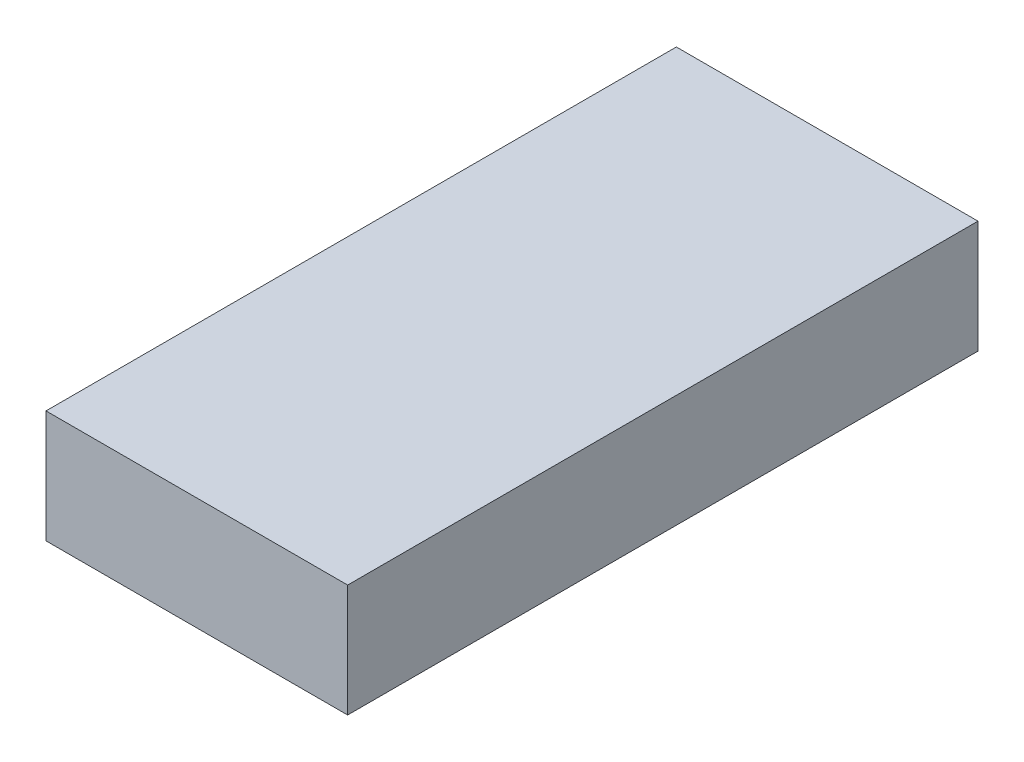
ISO-10303-21;
HEADER;
FILE_DESCRIPTION(('STEP AP214'),'2;1');
FILE_NAME('part.step','',(''),(''),'','','');
FILE_SCHEMA(('AUTOMOTIVE_DESIGN { 1 0 10303 214 1 1 1 1 }'));
ENDSEC;
DATA;
#1=APPLICATION_CONTEXT('core data for automotive mechanical design processes');
#2=APPLICATION_PROTOCOL_DEFINITION('international standard','automotive_design',2000,#1);
#3=PRODUCT_CONTEXT('',#1,'mechanical');
#4=PRODUCT('Part','Part','',(#3));
#5=PRODUCT_RELATED_PRODUCT_CATEGORY('part','',(#4));
#6=PRODUCT_DEFINITION_FORMATION('','',#4);
#7=PRODUCT_DEFINITION_CONTEXT('part definition',#1,'design');
#8=PRODUCT_DEFINITION('design','',#6,#7);
#9=PRODUCT_DEFINITION_SHAPE('','',#8);
#10=(LENGTH_UNIT() NAMED_UNIT(*) SI_UNIT(.MILLI.,.METRE.));
#11=(NAMED_UNIT(*) PLANE_ANGLE_UNIT() SI_UNIT($,.RADIAN.));
#12=(NAMED_UNIT(*) SI_UNIT($,.STERADIAN.) SOLID_ANGLE_UNIT());
#13=UNCERTAINTY_MEASURE_WITH_UNIT(LENGTH_MEASURE(1.E-05),#10,'distance_accuracy_value','');
#14=(GEOMETRIC_REPRESENTATION_CONTEXT(3) GLOBAL_UNCERTAINTY_ASSIGNED_CONTEXT((#13)) GLOBAL_UNIT_ASSIGNED_CONTEXT((#10,
#11,#12)) REPRESENTATION_CONTEXT('',''));
#15=CARTESIAN_POINT('',(0.,0.,0.));
#16=DIRECTION('',(0.,0.,1.));
#17=DIRECTION('',(1.,0.,0.));
#18=AXIS2_PLACEMENT_3D('',#15,#16,#17);
#19=CARTESIAN_POINT('',(-0.6700012,-0.2499995,2.79999948));
#20=DIRECTION('',(0.,0.,-1.));
#21=DIRECTION('',(0.,-1.,0.));
#22=AXIS2_PLACEMENT_3D('',#19,#20,#21);
#23=PLANE('',#22);
#24=DIRECTION('',(1.,0.,0.));
#25=VECTOR('',#24,1.);
#26=CARTESIAN_POINT('',(-0.6700012,-0.2499995,2.79999948));
#27=LINE('',#26,#25);
#28=CARTESIAN_POINT('',(-0.6700012,-0.2499995,2.79999948));
#29=VERTEX_POINT('',#28);
#30=CARTESIAN_POINT('',(0.6700012,-0.2499995,2.79999948));
#31=VERTEX_POINT('',#30);
#32=EDGE_CURVE('E80',#29,#31,#27,.T.);
#33=ORIENTED_EDGE('',*,*,#32,.T.);
#34=DIRECTION('',(0.,1.,0.));
#35=VECTOR('',#34,1.);
#36=CARTESIAN_POINT('',(0.6700012,-0.2499995,2.79999948));
#37=LINE('',#36,#35);
#38=CARTESIAN_POINT('',(0.6700012,0.2499995,2.79999948));
#39=VERTEX_POINT('',#38);
#40=EDGE_CURVE('E78',#31,#39,#37,.T.);
#41=ORIENTED_EDGE('',*,*,#40,.T.);
#42=DIRECTION('',(-1.,0.,0.));
#43=VECTOR('',#42,1.);
#44=CARTESIAN_POINT('',(0.6700012,0.2499995,2.79999948));
#45=LINE('',#44,#43);
#46=CARTESIAN_POINT('',(-0.6700012,0.2499995,2.79999948));
#47=VERTEX_POINT('',#46);
#48=EDGE_CURVE('E67',#39,#47,#45,.T.);
#49=ORIENTED_EDGE('',*,*,#48,.T.);
#50=DIRECTION('',(0.,-1.,0.));
#51=VECTOR('',#50,1.);
#52=CARTESIAN_POINT('',(-0.6700012,0.2499995,2.79999948));
#53=LINE('',#52,#51);
#54=EDGE_CURVE('E11',#47,#29,#53,.T.);
#55=ORIENTED_EDGE('',*,*,#54,.T.);
#56=EDGE_LOOP('',(#33,#41,#49,#55));
#57=FACE_BOUND('',#56,.T.);
#58=ADVANCED_FACE('F17',(#57),#23,.F.);
#59=CARTESIAN_POINT('',(-0.6700012,-0.2499995,0.));
#60=DIRECTION('',(0.,0.,-1.));
#61=DIRECTION('',(0.,-1.,0.));
#62=AXIS2_PLACEMENT_3D('',#59,#60,#61);
#63=PLANE('',#62);
#64=DIRECTION('',(0.,-1.,0.));
#65=VECTOR('',#64,1.);
#66=CARTESIAN_POINT('',(-0.6700012,0.2499995,0.));
#67=LINE('',#66,#65);
#68=CARTESIAN_POINT('',(-0.6700012,0.2499995,0.));
#69=VERTEX_POINT('',#68);
#70=CARTESIAN_POINT('',(-0.6700012,-0.2499995,0.));
#71=VERTEX_POINT('',#70);
#72=EDGE_CURVE('E28',#69,#71,#67,.T.);
#73=ORIENTED_EDGE('',*,*,#72,.F.);
#74=DIRECTION('',(-1.,0.,0.));
#75=VECTOR('',#74,1.);
#76=CARTESIAN_POINT('',(0.6700012,0.2499995,0.));
#77=LINE('',#76,#75);
#78=CARTESIAN_POINT('',(0.6700012,0.2499995,0.));
#79=VERTEX_POINT('',#78);
#80=EDGE_CURVE('E60',#79,#69,#77,.T.);
#81=ORIENTED_EDGE('',*,*,#80,.F.);
#82=DIRECTION('',(0.,1.,0.));
#83=VECTOR('',#82,1.);
#84=CARTESIAN_POINT('',(0.6700012,-0.2499995,0.));
#85=LINE('',#84,#83);
#86=CARTESIAN_POINT('',(0.6700012,-0.2499995,0.));
#87=VERTEX_POINT('',#86);
#88=EDGE_CURVE('E21',#87,#79,#85,.T.);
#89=ORIENTED_EDGE('',*,*,#88,.F.);
#90=DIRECTION('',(1.,0.,0.));
#91=VECTOR('',#90,1.);
#92=CARTESIAN_POINT('',(-0.6700012,-0.2499995,0.));
#93=LINE('',#92,#91);
#94=EDGE_CURVE('E106',#71,#87,#93,.T.);
#95=ORIENTED_EDGE('',*,*,#94,.F.);
#96=EDGE_LOOP('',(#73,#81,#89,#95));
#97=FACE_BOUND('',#96,.T.);
#98=ADVANCED_FACE('F121',(#97),#63,.T.);
#99=CARTESIAN_POINT('',(-0.6700012,0.2499995,0.));
#100=DIRECTION('',(1.,0.,0.));
#101=DIRECTION('',(0.,1.,0.));
#102=AXIS2_PLACEMENT_3D('',#99,#100,#101);
#103=PLANE('',#102);
#104=ORIENTED_EDGE('',*,*,#72,.T.);
#105=DIRECTION('',(0.,0.,1.));
#106=VECTOR('',#105,1.);
#107=CARTESIAN_POINT('',(-0.6700012,-0.2499995,0.));
#108=LINE('',#107,#106);
#109=EDGE_CURVE('E93',#71,#29,#108,.T.);
#110=ORIENTED_EDGE('',*,*,#109,.T.);
#111=ORIENTED_EDGE('',*,*,#54,.F.);
#112=DIRECTION('',(0.,0.,1.));
#113=VECTOR('',#112,1.);
#114=CARTESIAN_POINT('',(-0.6700012,0.2499995,0.));
#115=LINE('',#114,#113);
#116=EDGE_CURVE('E73',#69,#47,#115,.T.);
#117=ORIENTED_EDGE('',*,*,#116,.F.);
#118=EDGE_LOOP('',(#104,#110,#111,#117));
#119=FACE_BOUND('',#118,.T.);
#120=ADVANCED_FACE('F19',(#119),#103,.F.);
#121=CARTESIAN_POINT('',(0.6700012,0.2499995,0.));
#122=DIRECTION('',(0.,-1.,0.));
#123=DIRECTION('',(0.,0.,-1.));
#124=AXIS2_PLACEMENT_3D('',#121,#122,#123);
#125=PLANE('',#124);
#126=ORIENTED_EDGE('',*,*,#80,.T.);
#127=ORIENTED_EDGE('',*,*,#116,.T.);
#128=ORIENTED_EDGE('',*,*,#48,.F.);
#129=DIRECTION('',(0.,0.,1.));
#130=VECTOR('',#129,1.);
#131=CARTESIAN_POINT('',(0.6700012,0.2499995,0.));
#132=LINE('',#131,#130);
#133=EDGE_CURVE('E71',#79,#39,#132,.T.);
#134=ORIENTED_EDGE('',*,*,#133,.F.);
#135=EDGE_LOOP('',(#126,#127,#128,#134));
#136=FACE_BOUND('',#135,.T.);
#137=ADVANCED_FACE('F69',(#136),#125,.F.);
#138=CARTESIAN_POINT('',(0.6700012,-0.2499995,0.));
#139=DIRECTION('',(-1.,0.,0.));
#140=DIRECTION('',(0.,0.,1.));
#141=AXIS2_PLACEMENT_3D('',#138,#139,#140);
#142=PLANE('',#141);
#143=ORIENTED_EDGE('',*,*,#88,.T.);
#144=ORIENTED_EDGE('',*,*,#133,.T.);
#145=ORIENTED_EDGE('',*,*,#40,.F.);
#146=DIRECTION('',(0.,0.,1.));
#147=VECTOR('',#146,1.);
#148=CARTESIAN_POINT('',(0.6700012,-0.2499995,0.));
#149=LINE('',#148,#147);
#150=EDGE_CURVE('E95',#87,#31,#149,.T.);
#151=ORIENTED_EDGE('',*,*,#150,.F.);
#152=EDGE_LOOP('',(#143,#144,#145,#151));
#153=FACE_BOUND('',#152,.T.);
#154=ADVANCED_FACE('F86',(#153),#142,.F.);
#155=CARTESIAN_POINT('',(-0.6700012,-0.2499995,0.));
#156=DIRECTION('',(0.,1.,0.));
#157=DIRECTION('',(1.,0.,0.));
#158=AXIS2_PLACEMENT_3D('',#155,#156,#157);
#159=PLANE('',#158);
#160=ORIENTED_EDGE('',*,*,#94,.T.);
#161=ORIENTED_EDGE('',*,*,#150,.T.);
#162=ORIENTED_EDGE('',*,*,#32,.F.);
#163=ORIENTED_EDGE('',*,*,#109,.F.);
#164=EDGE_LOOP('',(#160,#161,#162,#163));
#165=FACE_BOUND('',#164,.T.);
#166=ADVANCED_FACE('F119',(#165),#159,.F.);
#167=CLOSED_SHELL('',(#58,#98,#120,#137,#154,#166));
#168=MANIFOLD_SOLID_BREP('B1',#167);
#169=ADVANCED_BREP_SHAPE_REPRESENTATION('',(#18,#168),#14);
#170=SHAPE_DEFINITION_REPRESENTATION(#9,#169);
ENDSEC;
END-ISO-10303-21;
